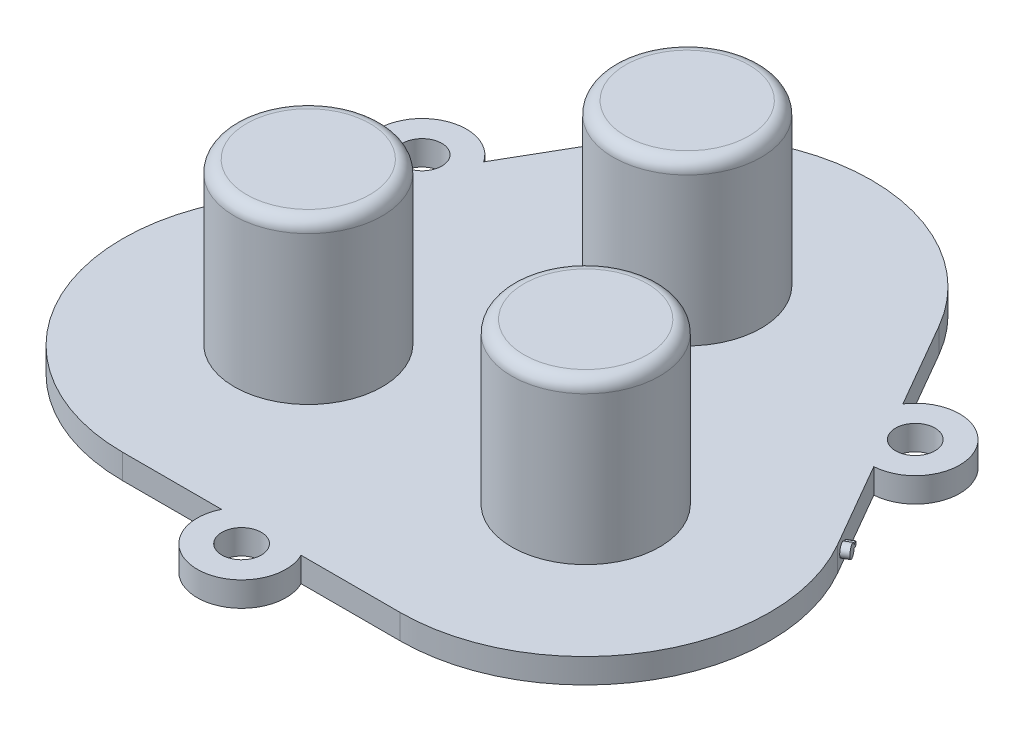
ISO-10303-21;
HEADER;
FILE_DESCRIPTION(('STEP AP214'),'2;1');
FILE_NAME('part.step','',(''),(''),'','','');
FILE_SCHEMA(('AUTOMOTIVE_DESIGN { 1 0 10303 214 1 1 1 1 }'));
ENDSEC;
DATA;
#1=APPLICATION_CONTEXT('core data for automotive mechanical design processes');
#2=APPLICATION_PROTOCOL_DEFINITION('international standard','automotive_design',2000,#1);
#3=PRODUCT_CONTEXT('',#1,'mechanical');
#4=PRODUCT('Part','Part','',(#3));
#5=PRODUCT_RELATED_PRODUCT_CATEGORY('part','',(#4));
#6=PRODUCT_DEFINITION_FORMATION('','',#4);
#7=PRODUCT_DEFINITION_CONTEXT('part definition',#1,'design');
#8=PRODUCT_DEFINITION('design','',#6,#7);
#9=PRODUCT_DEFINITION_SHAPE('','',#8);
#10=(LENGTH_UNIT() NAMED_UNIT(*) SI_UNIT(.MILLI.,.METRE.));
#11=(NAMED_UNIT(*) PLANE_ANGLE_UNIT() SI_UNIT($,.RADIAN.));
#12=(NAMED_UNIT(*) SI_UNIT($,.STERADIAN.) SOLID_ANGLE_UNIT());
#13=UNCERTAINTY_MEASURE_WITH_UNIT(LENGTH_MEASURE(1.E-05),#10,'distance_accuracy_value','');
#14=(GEOMETRIC_REPRESENTATION_CONTEXT(3) GLOBAL_UNCERTAINTY_ASSIGNED_CONTEXT((#13)) GLOBAL_UNIT_ASSIGNED_CONTEXT((#10,
#11,#12)) REPRESENTATION_CONTEXT('',''));
#15=CARTESIAN_POINT('',(0.,0.,0.));
#16=DIRECTION('',(0.,0.,1.));
#17=DIRECTION('',(1.,0.,0.));
#18=AXIS2_PLACEMENT_3D('',#15,#16,#17);
#19=CARTESIAN_POINT('',(-11.2500000511737,2.,7.14278559354404));
#20=DIRECTION('',(0.,1.,0.));
#21=DIRECTION('',(0.,0.,1.));
#22=AXIS2_PLACEMENT_3D('',#19,#20,#21);
#23=PLANE('',#22);
#24=CARTESIAN_POINT('',(-11.3100251260065,2.,7.02273544387849));
#25=DIRECTION('',(0.,1.,0.));
#26=DIRECTION('',(0.,0.,1.));
#27=AXIS2_PLACEMENT_3D('',#24,#25,#26);
#28=CIRCLE('',#27,6.);
#29=CARTESIAN_POINT('',(-11.3100251260065,2.,13.0227354438785));
#30=VERTEX_POINT('',#29);
#31=EDGE_CURVE('E330',#30,#30,#28,.F.);
#32=ORIENTED_EDGE('',*,*,#31,.T.);
#33=EDGE_LOOP('',(#32));
#34=FACE_BOUND('',#33,.T.);
#35=CARTESIAN_POINT('',(11.1899748739934,2.,7.02273544387849));
#36=DIRECTION('',(0.,1.,0.));
#37=DIRECTION('',(0.,0.,1.));
#38=AXIS2_PLACEMENT_3D('',#35,#36,#37);
#39=CIRCLE('',#38,6.);
#40=CARTESIAN_POINT('',(11.1899748739934,2.,13.0227354438785));
#41=VERTEX_POINT('',#40);
#42=EDGE_CURVE('E331',#41,#41,#39,.F.);
#43=ORIENTED_EDGE('',*,*,#42,.T.);
#44=EDGE_LOOP('',(#43));
#45=FACE_BOUND('',#44,.T.);
#46=CARTESIAN_POINT('',(-0.0600251260065108,2.,-12.4628361412714));
#47=DIRECTION('',(0.,1.,0.));
#48=DIRECTION('',(0.,0.,1.));
#49=AXIS2_PLACEMENT_3D('',#46,#47,#48);
#50=CIRCLE('',#49,6.);
#51=CARTESIAN_POINT('',(-0.0600251260065108,2.,-6.4628361412714));
#52=VERTEX_POINT('',#51);
#53=EDGE_CURVE('E335',#52,#52,#50,.F.);
#54=ORIENTED_EDGE('',*,*,#53,.T.);
#55=EDGE_LOOP('',(#54));
#56=FACE_BOUND('',#55,.T.);
#57=CARTESIAN_POINT('',(-20.0010217539954,2.,-10.9000001990309));
#58=DIRECTION('',(0.,1.,0.));
#59=DIRECTION('',(0.,0.,1.));
#60=AXIS2_PLACEMENT_3D('',#57,#58,#59);
#61=CIRCLE('',#60,1.6);
#62=CARTESIAN_POINT('',(-20.0010217539954,2.,-9.30000019903093));
#63=VERTEX_POINT('',#62);
#64=EDGE_CURVE('E350',#63,#63,#61,.T.);
#65=ORIENTED_EDGE('',*,*,#64,.F.);
#66=EDGE_LOOP('',(#65));
#67=FACE_BOUND('',#66,.T.);
#68=CARTESIAN_POINT('',(-11.2500000511737,2.,7.14278559354404));
#69=DIRECTION('',(0.,1.,0.));
#70=DIRECTION('',(0.,0.,1.));
#71=AXIS2_PLACEMENT_3D('',#68,#69,#70);
#72=CIRCLE('',#71,15.);
#73=CARTESIAN_POINT('',(-24.2403811079403,2.,-0.357214406455925));
#74=VERTEX_POINT('',#73);
#75=CARTESIAN_POINT('',(-11.2500000511737,2.,22.142785593544));
#76=VERTEX_POINT('',#75);
#77=EDGE_CURVE('E198',#74,#76,#72,.T.);
#78=ORIENTED_EDGE('',*,*,#77,.T.);
#79=DIRECTION('',(1.,0.,0.));
#80=VECTOR('',#79,1.);
#81=CARTESIAN_POINT('',(-11.2500000511737,2.,22.142785593544));
#82=LINE('',#81,#80);
#83=CARTESIAN_POINT('',(-3.2249031504929,2.,22.1427855935441));
#84=VERTEX_POINT('',#83);
#85=EDGE_CURVE('E118',#76,#84,#82,.T.);
#86=ORIENTED_EDGE('',*,*,#85,.T.);
#87=CARTESIAN_POINT('',(-5.11722688081806E-08,2.,23.7427855935431));
#88=DIRECTION('',(0.,1.,0.));
#89=DIRECTION('',(0.,0.,1.));
#90=AXIS2_PLACEMENT_3D('',#87,#88,#89);
#91=CIRCLE('',#90,3.60000000000066);
#92=CARTESIAN_POINT('',(3.22490304814838,2.,22.1427855935442));
#93=VERTEX_POINT('',#92);
#94=EDGE_CURVE('E362',#84,#93,#91,.T.);
#95=ORIENTED_EDGE('',*,*,#94,.T.);
#96=DIRECTION('',(1.,0.,0.));
#97=VECTOR('',#96,1.);
#98=CARTESIAN_POINT('',(3.22490304814839,2.,22.1427855935442));
#99=LINE('',#98,#97);
#100=CARTESIAN_POINT('',(11.2499999488263,2.,22.1427855935442));
#101=VERTEX_POINT('',#100);
#102=EDGE_CURVE('E364',#93,#101,#99,.T.);
#103=ORIENTED_EDGE('',*,*,#102,.T.);
#104=CARTESIAN_POINT('',(11.2499999488264,2.,7.14278559354415));
#105=DIRECTION('',(0.,1.,0.));
#106=DIRECTION('',(0.,0.,1.));
#107=AXIS2_PLACEMENT_3D('',#104,#105,#106);
#108=CIRCLE('',#107,15.0000000000001);
#109=CARTESIAN_POINT('',(24.240381005593,2.,-0.357214406456034));
#110=VERTEX_POINT('',#109);
#111=EDGE_CURVE('E366',#101,#110,#108,.T.);
#112=ORIENTED_EDGE('',*,*,#111,.T.);
#113=DIRECTION('',(-0.500000000000005,0.,-0.866025403784436));
#114=VECTOR('',#113,1.);
#115=CARTESIAN_POINT('',(24.240381005593,2.,-0.357214406456022));
#116=LINE('',#115,#114);
#117=CARTESIAN_POINT('',(20.2278325552526,2.,-7.30715219027712));
#118=VERTEX_POINT('',#117);
#119=EDGE_CURVE('E368',#110,#118,#116,.T.);
#120=ORIENTED_EDGE('',*,*,#119,.T.);
#121=CARTESIAN_POINT('',(20.0010216516479,2.,-10.9000001990326));
#122=DIRECTION('',(0.,1.,0.));
#123=DIRECTION('',(0.,0.,1.));
#124=AXIS2_PLACEMENT_3D('',#121,#122,#123);
#125=CIRCLE('',#124,3.60000000000172);
#126=CARTESIAN_POINT('',(17.0029294559317,2.,-12.8928482077873));
#127=VERTEX_POINT('',#126);
#128=EDGE_CURVE('E370',#118,#127,#125,.T.);
#129=ORIENTED_EDGE('',*,*,#128,.T.);
#130=DIRECTION('',(-0.500000000000005,0.,-0.866025403784436));
#131=VECTOR('',#130,1.);
#132=CARTESIAN_POINT('',(17.0029294559317,2.,-12.8928482077873));
#133=LINE('',#132,#131);
#134=CARTESIAN_POINT('',(12.9903810055928,2.,-19.8427859916058));
#135=VERTEX_POINT('',#134);
#136=EDGE_CURVE('E372',#127,#135,#133,.T.);
#137=ORIENTED_EDGE('',*,*,#136,.T.);
#138=CARTESIAN_POINT('',(-5.11737398924087E-08,2.,-12.3427859916057));
#139=DIRECTION('',(0.,1.,0.));
#140=DIRECTION('',(0.,0.,1.));
#141=AXIS2_PLACEMENT_3D('',#138,#139,#140);
#142=CIRCLE('',#141,15.0000000000001);
#143=CARTESIAN_POINT('',(-12.9903811079403,2.,-19.8427859916058));
#144=VERTEX_POINT('',#143);
#145=EDGE_CURVE('E153',#135,#144,#142,.T.);
#146=ORIENTED_EDGE('',*,*,#145,.T.);
#147=DIRECTION('',(-0.499999999999998,0.,0.86602540378444));
#148=VECTOR('',#147,1.);
#149=CARTESIAN_POINT('',(-12.9903811079403,2.,-19.8427859916058));
#150=LINE('',#149,#148);
#151=CARTESIAN_POINT('',(-17.0029295582806,2.,-12.8928482077847));
#152=VERTEX_POINT('',#151);
#153=EDGE_CURVE('E146',#144,#152,#150,.T.);
#154=ORIENTED_EDGE('',*,*,#153,.T.);
#155=CARTESIAN_POINT('',(-20.0010217539954,2.,-10.9000001990309));
#156=DIRECTION('',(0.,1.,0.));
#157=DIRECTION('',(0.,0.,1.));
#158=AXIS2_PLACEMENT_3D('',#155,#156,#157);
#159=CIRCLE('',#158,3.6);
#160=CARTESIAN_POINT('',(-20.2278326576,2.,-7.30715219027715));
#161=VERTEX_POINT('',#160);
#162=EDGE_CURVE('E150',#152,#161,#159,.T.);
#163=ORIENTED_EDGE('',*,*,#162,.T.);
#164=DIRECTION('',(-0.499999999999998,0.,0.86602540378444));
#165=VECTOR('',#164,1.);
#166=CARTESIAN_POINT('',(-20.2278326576,2.,-7.30715219027714));
#167=LINE('',#166,#165);
#168=EDGE_CURVE('E64',#161,#74,#167,.T.);
#169=ORIENTED_EDGE('',*,*,#168,.T.);
#170=EDGE_LOOP('',(#78,#86,#95,#103,#112,#120,#129,#137,#146,#154,#163,#169));
#171=FACE_BOUND('',#170,.T.);
#172=CARTESIAN_POINT('',(-5.11722688081806E-08,2.,23.7427855935431));
#173=DIRECTION('',(0.,1.,0.));
#174=DIRECTION('',(0.,0.,1.));
#175=AXIS2_PLACEMENT_3D('',#172,#173,#174);
#176=CIRCLE('',#175,1.60000000000066);
#177=CARTESIAN_POINT('',(-5.11722688081806E-08,2.,25.3427855935438));
#178=VERTEX_POINT('',#177);
#179=EDGE_CURVE('E178',#178,#178,#176,.T.);
#180=ORIENTED_EDGE('',*,*,#179,.F.);
#181=EDGE_LOOP('',(#180));
#182=FACE_BOUND('',#181,.T.);
#183=CARTESIAN_POINT('',(20.0010216516479,2.,-10.9000001990326));
#184=DIRECTION('',(0.,1.,0.));
#185=DIRECTION('',(0.,0.,1.));
#186=AXIS2_PLACEMENT_3D('',#183,#184,#185);
#187=CIRCLE('',#186,1.60000000000172);
#188=CARTESIAN_POINT('',(20.0010216516479,2.,-9.30000019903091));
#189=VERTEX_POINT('',#188);
#190=EDGE_CURVE('E344',#189,#189,#187,.T.);
#191=ORIENTED_EDGE('',*,*,#190,.F.);
#192=EDGE_LOOP('',(#191));
#193=FACE_BOUND('',#192,.T.);
#194=ADVANCED_FACE('F41',(#34,#45,#56,#67,#171,#182,#193),#23,.T.);
#195=CARTESIAN_POINT('',(-11.2500000511737,0.,7.14278559354404));
#196=DIRECTION('',(0.,1.,0.));
#197=DIRECTION('',(0.,0.,1.));
#198=AXIS2_PLACEMENT_3D('',#195,#196,#197);
#199=PLANE('',#198);
#200=CARTESIAN_POINT('',(-11.2500000511737,0.,7.14278559354404));
#201=DIRECTION('',(0.,1.,0.));
#202=DIRECTION('',(0.,0.,1.));
#203=AXIS2_PLACEMENT_3D('',#200,#201,#202);
#204=CIRCLE('',#203,15.);
#205=CARTESIAN_POINT('',(-24.2403811079403,0.,-0.357214406455925));
#206=VERTEX_POINT('',#205);
#207=CARTESIAN_POINT('',(-11.2500000511737,0.,22.142785593544));
#208=VERTEX_POINT('',#207);
#209=EDGE_CURVE('E174',#206,#208,#204,.T.);
#210=ORIENTED_EDGE('',*,*,#209,.F.);
#211=DIRECTION('',(-0.499999999999998,0.,0.86602540378444));
#212=VECTOR('',#211,1.);
#213=CARTESIAN_POINT('',(-20.2278326576,0.,-7.30715219027714));
#214=LINE('',#213,#212);
#215=CARTESIAN_POINT('',(-20.2278326576,0.,-7.30715219027715));
#216=VERTEX_POINT('',#215);
#217=EDGE_CURVE('E109',#216,#206,#214,.T.);
#218=ORIENTED_EDGE('',*,*,#217,.F.);
#219=CARTESIAN_POINT('',(-20.0010217539954,0.,-10.9000001990309));
#220=DIRECTION('',(0.,1.,0.));
#221=DIRECTION('',(0.,0.,1.));
#222=AXIS2_PLACEMENT_3D('',#219,#220,#221);
#223=CIRCLE('',#222,3.6);
#224=CARTESIAN_POINT('',(-17.0029295582806,0.,-12.8928482077847));
#225=VERTEX_POINT('',#224);
#226=EDGE_CURVE('E195',#225,#216,#223,.T.);
#227=ORIENTED_EDGE('',*,*,#226,.F.);
#228=DIRECTION('',(-0.499999999999998,0.,0.86602540378444));
#229=VECTOR('',#228,1.);
#230=CARTESIAN_POINT('',(-12.9903811079403,0.,-19.8427859916058));
#231=LINE('',#230,#229);
#232=CARTESIAN_POINT('',(-12.9903811079403,0.,-19.8427859916058));
#233=VERTEX_POINT('',#232);
#234=EDGE_CURVE('E162',#233,#225,#231,.T.);
#235=ORIENTED_EDGE('',*,*,#234,.F.);
#236=CARTESIAN_POINT('',(-5.11737398924087E-08,0.,-12.3427859916057));
#237=DIRECTION('',(0.,1.,0.));
#238=DIRECTION('',(0.,0.,1.));
#239=AXIS2_PLACEMENT_3D('',#236,#237,#238);
#240=CIRCLE('',#239,15.0000000000001);
#241=CARTESIAN_POINT('',(12.9903810055928,0.,-19.8427859916058));
#242=VERTEX_POINT('',#241);
#243=EDGE_CURVE('E192',#242,#233,#240,.T.);
#244=ORIENTED_EDGE('',*,*,#243,.F.);
#245=DIRECTION('',(-0.500000000000005,0.,-0.866025403784436));
#246=VECTOR('',#245,1.);
#247=CARTESIAN_POINT('',(17.0029294559317,0.,-12.8928482077873));
#248=LINE('',#247,#246);
#249=CARTESIAN_POINT('',(17.0029294559317,0.,-12.8928482077873));
#250=VERTEX_POINT('',#249);
#251=EDGE_CURVE('E190',#250,#242,#248,.T.);
#252=ORIENTED_EDGE('',*,*,#251,.F.);
#253=CARTESIAN_POINT('',(20.0010216516479,0.,-10.9000001990326));
#254=DIRECTION('',(0.,1.,0.));
#255=DIRECTION('',(0.,0.,1.));
#256=AXIS2_PLACEMENT_3D('',#253,#254,#255);
#257=CIRCLE('',#256,3.60000000000172);
#258=CARTESIAN_POINT('',(20.2278325552526,0.,-7.30715219027712));
#259=VERTEX_POINT('',#258);
#260=EDGE_CURVE('E188',#259,#250,#257,.T.);
#261=ORIENTED_EDGE('',*,*,#260,.F.);
#262=DIRECTION('',(-0.500000000000005,0.,-0.866025403784436));
#263=VECTOR('',#262,1.);
#264=CARTESIAN_POINT('',(24.240381005593,0.,-0.357214406456022));
#265=LINE('',#264,#263);
#266=CARTESIAN_POINT('',(24.240381005593,0.,-0.357214406456034));
#267=VERTEX_POINT('',#266);
#268=EDGE_CURVE('E186',#267,#259,#265,.T.);
#269=ORIENTED_EDGE('',*,*,#268,.F.);
#270=CARTESIAN_POINT('',(11.2499999488264,0.,7.14278559354415));
#271=DIRECTION('',(0.,1.,0.));
#272=DIRECTION('',(0.,0.,1.));
#273=AXIS2_PLACEMENT_3D('',#270,#271,#272);
#274=CIRCLE('',#273,15.0000000000001);
#275=CARTESIAN_POINT('',(11.2499999488263,0.,22.1427855935442));
#276=VERTEX_POINT('',#275);
#277=EDGE_CURVE('E184',#276,#267,#274,.T.);
#278=ORIENTED_EDGE('',*,*,#277,.F.);
#279=DIRECTION('',(1.,0.,0.));
#280=VECTOR('',#279,1.);
#281=CARTESIAN_POINT('',(3.22490304814839,0.,22.1427855935442));
#282=LINE('',#281,#280);
#283=CARTESIAN_POINT('',(3.22490304814838,0.,22.1427855935442));
#284=VERTEX_POINT('',#283);
#285=EDGE_CURVE('E182',#284,#276,#282,.T.);
#286=ORIENTED_EDGE('',*,*,#285,.F.);
#287=CARTESIAN_POINT('',(-5.11722688081806E-08,0.,23.7427855935431));
#288=DIRECTION('',(0.,1.,0.));
#289=DIRECTION('',(0.,0.,1.));
#290=AXIS2_PLACEMENT_3D('',#287,#288,#289);
#291=CIRCLE('',#290,3.60000000000066);
#292=CARTESIAN_POINT('',(-3.2249031504929,0.,22.1427855935441));
#293=VERTEX_POINT('',#292);
#294=EDGE_CURVE('E180',#293,#284,#291,.T.);
#295=ORIENTED_EDGE('',*,*,#294,.F.);
#296=DIRECTION('',(1.,0.,0.));
#297=VECTOR('',#296,1.);
#298=CARTESIAN_POINT('',(-11.2500000511737,0.,22.142785593544));
#299=LINE('',#298,#297);
#300=EDGE_CURVE('E177',#208,#293,#299,.T.);
#301=ORIENTED_EDGE('',*,*,#300,.F.);
#302=EDGE_LOOP('',(#210,#218,#227,#235,#244,#252,#261,#269,#278,#286,#295,#301));
#303=FACE_BOUND('',#302,.T.);
#304=CARTESIAN_POINT('',(-5.11722688081806E-08,0.,23.7427855935431));
#305=DIRECTION('',(0.,1.,0.));
#306=DIRECTION('',(0.,0.,1.));
#307=AXIS2_PLACEMENT_3D('',#304,#305,#306);
#308=CIRCLE('',#307,1.60000000000066);
#309=CARTESIAN_POINT('',(-5.11722688081806E-08,0.,25.3427855935438));
#310=VERTEX_POINT('',#309);
#311=EDGE_CURVE('E353',#310,#310,#308,.T.);
#312=ORIENTED_EDGE('',*,*,#311,.T.);
#313=EDGE_LOOP('',(#312));
#314=FACE_BOUND('',#313,.T.);
#315=CARTESIAN_POINT('',(-20.0010217539954,0.,-10.9000001990309));
#316=DIRECTION('',(0.,1.,0.));
#317=DIRECTION('',(0.,0.,1.));
#318=AXIS2_PLACEMENT_3D('',#315,#316,#317);
#319=CIRCLE('',#318,1.6);
#320=CARTESIAN_POINT('',(-20.0010217539954,0.,-9.30000019903093));
#321=VERTEX_POINT('',#320);
#322=EDGE_CURVE('E347',#321,#321,#319,.T.);
#323=ORIENTED_EDGE('',*,*,#322,.T.);
#324=EDGE_LOOP('',(#323));
#325=FACE_BOUND('',#324,.T.);
#326=CARTESIAN_POINT('',(20.0010216516479,0.,-10.9000001990326));
#327=DIRECTION('',(0.,1.,0.));
#328=DIRECTION('',(0.,0.,1.));
#329=AXIS2_PLACEMENT_3D('',#326,#327,#328);
#330=CIRCLE('',#329,1.60000000000172);
#331=CARTESIAN_POINT('',(20.0010216516479,0.,-9.30000019903091));
#332=VERTEX_POINT('',#331);
#333=EDGE_CURVE('E343',#332,#332,#330,.T.);
#334=ORIENTED_EDGE('',*,*,#333,.T.);
#335=EDGE_LOOP('',(#334));
#336=FACE_BOUND('',#335,.T.);
#337=ADVANCED_FACE('F257',(#303,#314,#325,#336),#199,.F.);
#338=CARTESIAN_POINT('',(-11.2500000511737,2.,7.14278559354404));
#339=DIRECTION('',(0.,-1.,0.));
#340=DIRECTION('',(0.,0.,-1.));
#341=AXIS2_PLACEMENT_3D('',#338,#339,#340);
#342=CYLINDRICAL_SURFACE('',#341,15.);
#343=ORIENTED_EDGE('',*,*,#209,.T.);
#344=DIRECTION('',(0.,-1.,0.));
#345=VECTOR('',#344,1.);
#346=CARTESIAN_POINT('',(-11.2500000511737,2.,22.142785593544));
#347=LINE('',#346,#345);
#348=EDGE_CURVE('E223',#76,#208,#347,.T.);
#349=ORIENTED_EDGE('',*,*,#348,.F.);
#350=ORIENTED_EDGE('',*,*,#77,.F.);
#351=DIRECTION('',(0.,-1.,0.));
#352=VECTOR('',#351,1.);
#353=CARTESIAN_POINT('',(-24.2403811079403,2.,-0.357214406455925));
#354=LINE('',#353,#352);
#355=EDGE_CURVE('E170',#74,#206,#354,.T.);
#356=ORIENTED_EDGE('',*,*,#355,.T.);
#357=EDGE_LOOP('',(#343,#349,#350,#356));
#358=FACE_BOUND('',#357,.T.);
#359=ADVANCED_FACE('F264',(#358),#342,.T.);
#360=CARTESIAN_POINT('',(-11.2500000511737,2.,22.142785593544));
#361=DIRECTION('',(0.,0.,-1.));
#362=DIRECTION('',(-1.,0.,0.));
#363=AXIS2_PLACEMENT_3D('',#360,#361,#362);
#364=PLANE('',#363);
#365=ORIENTED_EDGE('',*,*,#300,.T.);
#366=DIRECTION('',(0.,-1.,0.));
#367=VECTOR('',#366,1.);
#368=CARTESIAN_POINT('',(-3.2249031504929,2.,22.1427855935441));
#369=LINE('',#368,#367);
#370=EDGE_CURVE('E220',#84,#293,#369,.T.);
#371=ORIENTED_EDGE('',*,*,#370,.F.);
#372=ORIENTED_EDGE('',*,*,#85,.F.);
#373=ORIENTED_EDGE('',*,*,#348,.T.);
#374=EDGE_LOOP('',(#365,#371,#372,#373));
#375=FACE_BOUND('',#374,.T.);
#376=ADVANCED_FACE('F305',(#375),#364,.F.);
#377=CARTESIAN_POINT('',(-5.11722688081806E-08,2.,23.7427855935431));
#378=DIRECTION('',(0.,-1.,0.));
#379=DIRECTION('',(0.,0.,-1.));
#380=AXIS2_PLACEMENT_3D('',#377,#378,#379);
#381=CYLINDRICAL_SURFACE('',#380,3.60000000000066);
#382=ORIENTED_EDGE('',*,*,#294,.T.);
#383=DIRECTION('',(0.,-1.,0.));
#384=VECTOR('',#383,1.);
#385=CARTESIAN_POINT('',(3.22490304814838,2.,22.1427855935442));
#386=LINE('',#385,#384);
#387=EDGE_CURVE('E217',#93,#284,#386,.T.);
#388=ORIENTED_EDGE('',*,*,#387,.F.);
#389=ORIENTED_EDGE('',*,*,#94,.F.);
#390=ORIENTED_EDGE('',*,*,#370,.T.);
#391=EDGE_LOOP('',(#382,#388,#389,#390));
#392=FACE_BOUND('',#391,.T.);
#393=ADVANCED_FACE('F301',(#392),#381,.T.);
#394=CARTESIAN_POINT('',(3.22490304814839,2.,22.1427855935442));
#395=DIRECTION('',(0.,0.,-1.));
#396=DIRECTION('',(-1.,0.,0.));
#397=AXIS2_PLACEMENT_3D('',#394,#395,#396);
#398=PLANE('',#397);
#399=ORIENTED_EDGE('',*,*,#285,.T.);
#400=DIRECTION('',(0.,-1.,0.));
#401=VECTOR('',#400,1.);
#402=CARTESIAN_POINT('',(11.2499999488263,2.,22.1427855935442));
#403=LINE('',#402,#401);
#404=EDGE_CURVE('E214',#101,#276,#403,.T.);
#405=ORIENTED_EDGE('',*,*,#404,.F.);
#406=ORIENTED_EDGE('',*,*,#102,.F.);
#407=ORIENTED_EDGE('',*,*,#387,.T.);
#408=EDGE_LOOP('',(#399,#405,#406,#407));
#409=FACE_BOUND('',#408,.T.);
#410=ADVANCED_FACE('F297',(#409),#398,.F.);
#411=CARTESIAN_POINT('',(11.2499999488264,2.,7.14278559354415));
#412=DIRECTION('',(0.,-1.,0.));
#413=DIRECTION('',(0.,0.,-1.));
#414=AXIS2_PLACEMENT_3D('',#411,#412,#413);
#415=CYLINDRICAL_SURFACE('',#414,15.0000000000001);
#416=ORIENTED_EDGE('',*,*,#277,.T.);
#417=DIRECTION('',(0.,-1.,0.));
#418=VECTOR('',#417,1.);
#419=CARTESIAN_POINT('',(24.240381005593,2.,-0.357214406456034));
#420=LINE('',#419,#418);
#421=EDGE_CURVE('E211',#110,#267,#420,.T.);
#422=ORIENTED_EDGE('',*,*,#421,.F.);
#423=ORIENTED_EDGE('',*,*,#111,.F.);
#424=ORIENTED_EDGE('',*,*,#404,.T.);
#425=EDGE_LOOP('',(#416,#422,#423,#424));
#426=FACE_BOUND('',#425,.T.);
#427=ADVANCED_FACE('F294',(#426),#415,.T.);
#428=CARTESIAN_POINT('',(24.240381005593,2.,-0.357214406456022));
#429=DIRECTION('',(-0.866025403784436,0.,0.500000000000005));
#430=DIRECTION('',(0.500000000000005,0.,0.866025403784436));
#431=AXIS2_PLACEMENT_3D('',#428,#429,#430);
#432=PLANE('',#431);
#433=CARTESIAN_POINT('',(23.4095247745026,1.,-1.7962996124898));
#434=DIRECTION('',(0.866025403784436,0.,-0.500000000000005));
#435=DIRECTION('',(-0.500000000000005,0.,-0.866025403784436));
#436=AXIS2_PLACEMENT_3D('',#433,#434,#435);
#437=CIRCLE('',#436,0.199999999999999);
#438=CARTESIAN_POINT('',(23.5059716138844,0.947160349234695,-1.62924878645098));
#439=VERTEX_POINT('',#438);
#440=CARTESIAN_POINT('',(23.5059716138844,1.05283965076531,-1.62924878645098));
#441=VERTEX_POINT('',#440);
#442=EDGE_CURVE('E446',#439,#441,#437,.T.);
#443=ORIENTED_EDGE('',*,*,#442,.F.);
#444=CARTESIAN_POINT('',(23.7545716799076,1.,-1.19866084133379));
#445=DIRECTION('',(0.866025403784436,0.,-0.500000000000005));
#446=DIRECTION('',(-0.500000000000005,0.,-0.866025403784436));
#447=AXIS2_PLACEMENT_3D('',#444,#445,#446);
#448=CIRCLE('',#447,0.5);
#449=EDGE_CURVE('E55',#441,#439,#448,.T.);
#450=ORIENTED_EDGE('',*,*,#449,.F.);
#451=EDGE_LOOP('',(#443,#450));
#452=FACE_BOUND('',#451,.T.);
#453=ORIENTED_EDGE('',*,*,#268,.T.);
#454=DIRECTION('',(0.,-1.,0.));
#455=VECTOR('',#454,1.);
#456=CARTESIAN_POINT('',(20.2278325552526,2.,-7.30715219027712));
#457=LINE('',#456,#455);
#458=EDGE_CURVE('E208',#118,#259,#457,.T.);
#459=ORIENTED_EDGE('',*,*,#458,.F.);
#460=ORIENTED_EDGE('',*,*,#119,.F.);
#461=ORIENTED_EDGE('',*,*,#421,.T.);
#462=EDGE_LOOP('',(#453,#459,#460,#461));
#463=FACE_BOUND('',#462,.T.);
#464=ADVANCED_FACE('F291',(#452,#463),#432,.F.);
#465=CARTESIAN_POINT('',(20.0010216516479,2.,-10.9000001990326));
#466=DIRECTION('',(0.,-1.,0.));
#467=DIRECTION('',(0.,0.,-1.));
#468=AXIS2_PLACEMENT_3D('',#465,#466,#467);
#469=CYLINDRICAL_SURFACE('',#468,3.60000000000172);
#470=ORIENTED_EDGE('',*,*,#260,.T.);
#471=DIRECTION('',(0.,-1.,0.));
#472=VECTOR('',#471,1.);
#473=CARTESIAN_POINT('',(17.0029294559317,2.,-12.8928482077873));
#474=LINE('',#473,#472);
#475=EDGE_CURVE('E205',#127,#250,#474,.T.);
#476=ORIENTED_EDGE('',*,*,#475,.F.);
#477=ORIENTED_EDGE('',*,*,#128,.F.);
#478=ORIENTED_EDGE('',*,*,#458,.T.);
#479=EDGE_LOOP('',(#470,#476,#477,#478));
#480=FACE_BOUND('',#479,.T.);
#481=ADVANCED_FACE('F287',(#480),#469,.T.);
#482=CARTESIAN_POINT('',(17.0029294559317,2.,-12.8928482077873));
#483=DIRECTION('',(-0.866025403784436,0.,0.500000000000005));
#484=DIRECTION('',(0.500000000000005,0.,0.866025403784436));
#485=AXIS2_PLACEMENT_3D('',#482,#483,#484);
#486=PLANE('',#485);
#487=ORIENTED_EDGE('',*,*,#251,.T.);
#488=DIRECTION('',(0.,-1.,0.));
#489=VECTOR('',#488,1.);
#490=CARTESIAN_POINT('',(12.9903810055928,2.,-19.8427859916058));
#491=LINE('',#490,#489);
#492=EDGE_CURVE('E202',#135,#242,#491,.T.);
#493=ORIENTED_EDGE('',*,*,#492,.F.);
#494=ORIENTED_EDGE('',*,*,#136,.F.);
#495=ORIENTED_EDGE('',*,*,#475,.T.);
#496=EDGE_LOOP('',(#487,#493,#494,#495));
#497=FACE_BOUND('',#496,.T.);
#498=ADVANCED_FACE('F283',(#497),#486,.F.);
#499=CARTESIAN_POINT('',(-5.11737398924087E-08,2.,-12.3427859916057));
#500=DIRECTION('',(0.,-1.,0.));
#501=DIRECTION('',(0.,0.,-1.));
#502=AXIS2_PLACEMENT_3D('',#499,#500,#501);
#503=CYLINDRICAL_SURFACE('',#502,15.0000000000001);
#504=ORIENTED_EDGE('',*,*,#243,.T.);
#505=DIRECTION('',(0.,-1.,0.));
#506=VECTOR('',#505,1.);
#507=CARTESIAN_POINT('',(-12.9903811079403,2.,-19.8427859916058));
#508=LINE('',#507,#506);
#509=EDGE_CURVE('E165',#144,#233,#508,.T.);
#510=ORIENTED_EDGE('',*,*,#509,.F.);
#511=ORIENTED_EDGE('',*,*,#145,.F.);
#512=ORIENTED_EDGE('',*,*,#492,.T.);
#513=EDGE_LOOP('',(#504,#510,#511,#512));
#514=FACE_BOUND('',#513,.T.);
#515=ADVANCED_FACE('F280',(#514),#503,.T.);
#516=CARTESIAN_POINT('',(-12.9903811079403,2.,-19.8427859916058));
#517=DIRECTION('',(0.86602540378444,0.,0.499999999999998));
#518=DIRECTION('',(0.499999999999998,0.,-0.86602540378444));
#519=AXIS2_PLACEMENT_3D('',#516,#517,#518);
#520=PLANE('',#519);
#521=ORIENTED_EDGE('',*,*,#234,.T.);
#522=DIRECTION('',(0.,-1.,0.));
#523=VECTOR('',#522,1.);
#524=CARTESIAN_POINT('',(-17.0029295582806,2.,-12.8928482077847));
#525=LINE('',#524,#523);
#526=EDGE_CURVE('E159',#152,#225,#525,.T.);
#527=ORIENTED_EDGE('',*,*,#526,.F.);
#528=ORIENTED_EDGE('',*,*,#153,.F.);
#529=ORIENTED_EDGE('',*,*,#509,.T.);
#530=EDGE_LOOP('',(#521,#527,#528,#529));
#531=FACE_BOUND('',#530,.T.);
#532=ADVANCED_FACE('F160',(#531),#520,.F.);
#533=CARTESIAN_POINT('',(-20.0010217539954,2.,-10.9000001990309));
#534=DIRECTION('',(0.,-1.,0.));
#535=DIRECTION('',(0.,0.,-1.));
#536=AXIS2_PLACEMENT_3D('',#533,#534,#535);
#537=CYLINDRICAL_SURFACE('',#536,3.6);
#538=ORIENTED_EDGE('',*,*,#226,.T.);
#539=DIRECTION('',(0.,-1.,0.));
#540=VECTOR('',#539,1.);
#541=CARTESIAN_POINT('',(-20.2278326576,2.,-7.30715219027715));
#542=LINE('',#541,#540);
#543=EDGE_CURVE('E166',#161,#216,#542,.T.);
#544=ORIENTED_EDGE('',*,*,#543,.F.);
#545=ORIENTED_EDGE('',*,*,#162,.F.);
#546=ORIENTED_EDGE('',*,*,#526,.T.);
#547=EDGE_LOOP('',(#538,#544,#545,#546));
#548=FACE_BOUND('',#547,.T.);
#549=ADVANCED_FACE('F168',(#548),#537,.T.);
#550=CARTESIAN_POINT('',(-20.2278326576,2.,-7.30715219027714));
#551=DIRECTION('',(0.86602540378444,0.,0.499999999999998));
#552=DIRECTION('',(0.499999999999998,0.,-0.86602540378444));
#553=AXIS2_PLACEMENT_3D('',#550,#551,#552);
#554=PLANE('',#553);
#555=ORIENTED_EDGE('',*,*,#217,.T.);
#556=ORIENTED_EDGE('',*,*,#355,.F.);
#557=ORIENTED_EDGE('',*,*,#168,.F.);
#558=ORIENTED_EDGE('',*,*,#543,.T.);
#559=EDGE_LOOP('',(#555,#556,#557,#558));
#560=FACE_BOUND('',#559,.T.);
#561=ADVANCED_FACE('F273',(#560),#554,.F.);
#562=CARTESIAN_POINT('',(-5.11722688081806E-08,2.,23.7427855935431));
#563=DIRECTION('',(0.,-1.,0.));
#564=DIRECTION('',(0.,0.,-1.));
#565=AXIS2_PLACEMENT_3D('',#562,#563,#564);
#566=CYLINDRICAL_SURFACE('',#565,1.60000000000066);
#567=ORIENTED_EDGE('',*,*,#179,.T.);
#568=EDGE_LOOP('',(#567));
#569=FACE_BOUND('',#568,.T.);
#570=ORIENTED_EDGE('',*,*,#311,.F.);
#571=EDGE_LOOP('',(#570));
#572=FACE_BOUND('',#571,.T.);
#573=ADVANCED_FACE('F270',(#569,#572),#566,.F.);
#574=CARTESIAN_POINT('',(-20.0010217539954,2.,-10.9000001990309));
#575=DIRECTION('',(0.,-1.,0.));
#576=DIRECTION('',(0.,0.,-1.));
#577=AXIS2_PLACEMENT_3D('',#574,#575,#576);
#578=CYLINDRICAL_SURFACE('',#577,1.6);
#579=ORIENTED_EDGE('',*,*,#64,.T.);
#580=EDGE_LOOP('',(#579));
#581=FACE_BOUND('',#580,.T.);
#582=ORIENTED_EDGE('',*,*,#322,.F.);
#583=EDGE_LOOP('',(#582));
#584=FACE_BOUND('',#583,.T.);
#585=ADVANCED_FACE('F405',(#581,#584),#578,.F.);
#586=CARTESIAN_POINT('',(20.0010216516479,2.,-10.9000001990326));
#587=DIRECTION('',(0.,-1.,0.));
#588=DIRECTION('',(0.,0.,-1.));
#589=AXIS2_PLACEMENT_3D('',#586,#587,#588);
#590=CYLINDRICAL_SURFACE('',#589,1.60000000000172);
#591=ORIENTED_EDGE('',*,*,#190,.T.);
#592=EDGE_LOOP('',(#591));
#593=FACE_BOUND('',#592,.T.);
#594=ORIENTED_EDGE('',*,*,#333,.F.);
#595=EDGE_LOOP('',(#594));
#596=FACE_BOUND('',#595,.T.);
#597=ADVANCED_FACE('F403',(#593,#596),#590,.F.);
#598=CARTESIAN_POINT('',(-0.0600251260065108,15.,-12.4628361412714));
#599=DIRECTION('',(0.,-1.,0.));
#600=DIRECTION('',(0.,0.,-1.));
#601=AXIS2_PLACEMENT_3D('',#598,#599,#600);
#602=CYLINDRICAL_SURFACE('',#601,6.);
#603=CARTESIAN_POINT('',(-0.0600251260065108,14.,-12.4628361412714));
#604=DIRECTION('',(0.,1.,0.));
#605=DIRECTION('',(0.,0.,1.));
#606=AXIS2_PLACEMENT_3D('',#603,#604,#605);
#607=CIRCLE('',#606,6.);
#608=CARTESIAN_POINT('',(-0.0600251260065108,14.,-6.4628361412714));
#609=VERTEX_POINT('',#608);
#610=EDGE_CURVE('E11',#609,#609,#607,.F.);
#611=ORIENTED_EDGE('',*,*,#610,.T.);
#612=EDGE_LOOP('',(#611));
#613=FACE_BOUND('',#612,.T.);
#614=ORIENTED_EDGE('',*,*,#53,.F.);
#615=EDGE_LOOP('',(#614));
#616=FACE_BOUND('',#615,.T.);
#617=ADVANCED_FACE('F404',(#613,#616),#602,.T.);
#618=CARTESIAN_POINT('',(-0.0600251260065108,15.,-12.4628361412714));
#619=DIRECTION('',(0.,1.,0.));
#620=DIRECTION('',(0.,0.,1.));
#621=AXIS2_PLACEMENT_3D('',#618,#619,#620);
#622=PLANE('',#621);
#623=CARTESIAN_POINT('',(-0.0600251260065108,15.,-12.4628361412714));
#624=DIRECTION('',(0.,1.,0.));
#625=DIRECTION('',(0.,0.,1.));
#626=AXIS2_PLACEMENT_3D('',#623,#624,#625);
#627=CIRCLE('',#626,5.);
#628=CARTESIAN_POINT('',(-0.0600251260065108,15.,-7.4628361412714));
#629=VERTEX_POINT('',#628);
#630=EDGE_CURVE('E49',#629,#629,#627,.T.);
#631=ORIENTED_EDGE('',*,*,#630,.T.);
#632=EDGE_LOOP('',(#631));
#633=FACE_BOUND('',#632,.T.);
#634=ADVANCED_FACE('F239',(#633),#622,.T.);
#635=CARTESIAN_POINT('',(11.1899748739934,15.,7.02273544387849));
#636=DIRECTION('',(0.,-1.,0.));
#637=DIRECTION('',(0.,0.,-1.));
#638=AXIS2_PLACEMENT_3D('',#635,#636,#637);
#639=CYLINDRICAL_SURFACE('',#638,6.);
#640=CARTESIAN_POINT('',(11.1899748739934,14.,7.02273544387849));
#641=DIRECTION('',(0.,1.,0.));
#642=DIRECTION('',(0.,0.,1.));
#643=AXIS2_PLACEMENT_3D('',#640,#641,#642);
#644=CIRCLE('',#643,6.);
#645=CARTESIAN_POINT('',(11.1899748739934,14.,13.0227354438785));
#646=VERTEX_POINT('',#645);
#647=EDGE_CURVE('E234',#646,#646,#644,.F.);
#648=ORIENTED_EDGE('',*,*,#647,.T.);
#649=EDGE_LOOP('',(#648));
#650=FACE_BOUND('',#649,.T.);
#651=ORIENTED_EDGE('',*,*,#42,.F.);
#652=EDGE_LOOP('',(#651));
#653=FACE_BOUND('',#652,.T.);
#654=ADVANCED_FACE('F418',(#650,#653),#639,.T.);
#655=CARTESIAN_POINT('',(11.1899748739934,15.,7.02273544387849));
#656=DIRECTION('',(0.,1.,0.));
#657=DIRECTION('',(0.,0.,1.));
#658=AXIS2_PLACEMENT_3D('',#655,#656,#657);
#659=PLANE('',#658);
#660=CARTESIAN_POINT('',(11.1899748739934,15.,7.02273544387849));
#661=DIRECTION('',(0.,1.,0.));
#662=DIRECTION('',(0.,0.,1.));
#663=AXIS2_PLACEMENT_3D('',#660,#661,#662);
#664=CIRCLE('',#663,5.);
#665=CARTESIAN_POINT('',(11.1899748739934,15.,12.0227354438785));
#666=VERTEX_POINT('',#665);
#667=EDGE_CURVE('E231',#666,#666,#664,.T.);
#668=ORIENTED_EDGE('',*,*,#667,.T.);
#669=EDGE_LOOP('',(#668));
#670=FACE_BOUND('',#669,.T.);
#671=ADVANCED_FACE('F327',(#670),#659,.T.);
#672=CARTESIAN_POINT('',(-11.3100251260065,15.,7.02273544387849));
#673=DIRECTION('',(0.,-1.,0.));
#674=DIRECTION('',(0.,0.,-1.));
#675=AXIS2_PLACEMENT_3D('',#672,#673,#674);
#676=CYLINDRICAL_SURFACE('',#675,6.);
#677=CARTESIAN_POINT('',(-11.3100251260065,14.,7.02273544387849));
#678=DIRECTION('',(0.,1.,0.));
#679=DIRECTION('',(0.,0.,1.));
#680=AXIS2_PLACEMENT_3D('',#677,#678,#679);
#681=CIRCLE('',#680,6.);
#682=CARTESIAN_POINT('',(-11.3100251260065,14.,13.0227354438785));
#683=VERTEX_POINT('',#682);
#684=EDGE_CURVE('E228',#683,#683,#681,.F.);
#685=ORIENTED_EDGE('',*,*,#684,.T.);
#686=EDGE_LOOP('',(#685));
#687=FACE_BOUND('',#686,.T.);
#688=ORIENTED_EDGE('',*,*,#31,.F.);
#689=EDGE_LOOP('',(#688));
#690=FACE_BOUND('',#689,.T.);
#691=ADVANCED_FACE('F318',(#687,#690),#676,.T.);
#692=CARTESIAN_POINT('',(-11.3100251260065,15.,7.02273544387849));
#693=DIRECTION('',(0.,1.,0.));
#694=DIRECTION('',(0.,0.,1.));
#695=AXIS2_PLACEMENT_3D('',#692,#693,#694);
#696=PLANE('',#695);
#697=CARTESIAN_POINT('',(-11.3100251260065,15.,7.02273544387849));
#698=DIRECTION('',(0.,1.,0.));
#699=DIRECTION('',(0.,0.,1.));
#700=AXIS2_PLACEMENT_3D('',#697,#698,#699);
#701=CIRCLE('',#700,5.);
#702=CARTESIAN_POINT('',(-11.3100251260065,15.,12.0227354438785));
#703=VERTEX_POINT('',#702);
#704=EDGE_CURVE('E225',#703,#703,#701,.T.);
#705=ORIENTED_EDGE('',*,*,#704,.T.);
#706=EDGE_LOOP('',(#705));
#707=FACE_BOUND('',#706,.T.);
#708=ADVANCED_FACE('F313',(#707),#696,.T.);
#709=CARTESIAN_POINT('',(-11.3100251260065,14.,7.02273544387849));
#710=DIRECTION('',(0.,1.,0.));
#711=DIRECTION('',(0.,0.,1.));
#712=AXIS2_PLACEMENT_3D('',#709,#710,#711);
#713=TOROIDAL_SURFACE('',#712,5.,1.);
#714=ORIENTED_EDGE('',*,*,#684,.F.);
#715=EDGE_LOOP('',(#714));
#716=FACE_BOUND('',#715,.T.);
#717=ORIENTED_EDGE('',*,*,#704,.F.);
#718=EDGE_LOOP('',(#717));
#719=FACE_BOUND('',#718,.T.);
#720=ADVANCED_FACE('F253',(#716,#719),#713,.T.);
#721=CARTESIAN_POINT('',(11.1899748739934,14.,7.02273544387849));
#722=DIRECTION('',(0.,1.,0.));
#723=DIRECTION('',(0.,0.,1.));
#724=AXIS2_PLACEMENT_3D('',#721,#722,#723);
#725=TOROIDAL_SURFACE('',#724,5.,1.);
#726=ORIENTED_EDGE('',*,*,#647,.F.);
#727=EDGE_LOOP('',(#726));
#728=FACE_BOUND('',#727,.T.);
#729=ORIENTED_EDGE('',*,*,#667,.F.);
#730=EDGE_LOOP('',(#729));
#731=FACE_BOUND('',#730,.T.);
#732=ADVANCED_FACE('F243',(#728,#731),#725,.T.);
#733=CARTESIAN_POINT('',(-0.0600251260065108,14.,-12.4628361412714));
#734=DIRECTION('',(0.,1.,0.));
#735=DIRECTION('',(0.,0.,1.));
#736=AXIS2_PLACEMENT_3D('',#733,#734,#735);
#737=TOROIDAL_SURFACE('',#736,5.,1.);
#738=ORIENTED_EDGE('',*,*,#610,.F.);
#739=EDGE_LOOP('',(#738));
#740=FACE_BOUND('',#739,.T.);
#741=ORIENTED_EDGE('',*,*,#630,.F.);
#742=EDGE_LOOP('',(#741));
#743=FACE_BOUND('',#742,.T.);
#744=ADVANCED_FACE('F43',(#740,#743),#737,.T.);
#745=CARTESIAN_POINT('',(23.9291400167732,1.,-2.0962996124898));
#746=DIRECTION('',(-0.866025403784436,0.,0.500000000000005));
#747=DIRECTION('',(0.500000000000005,0.,0.866025403784436));
#748=AXIS2_PLACEMENT_3D('',#745,#746,#747);
#749=CYLINDRICAL_SURFACE('',#748,0.199999999999999);
#750=ORIENTED_EDGE('',*,*,#442,.T.);
#751=DIRECTION('',(-0.866025403784436,0.,0.500000000000005));
#752=VECTOR('',#751,1.);
#753=CARTESIAN_POINT('',(24.0255868561551,1.05283965076531,-1.92924878645099));
#754=LINE('',#753,#752);
#755=CARTESIAN_POINT('',(24.0255868561551,1.05283965076531,-1.92924878645099));
#756=VERTEX_POINT('',#755);
#757=EDGE_CURVE('E332',#756,#441,#754,.T.);
#758=ORIENTED_EDGE('',*,*,#757,.F.);
#759=CARTESIAN_POINT('',(23.9291400167732,1.,-2.0962996124898));
#760=DIRECTION('',(0.866025403784436,0.,-0.500000000000005));
#761=DIRECTION('',(-0.500000000000005,0.,-0.866025403784436));
#762=AXIS2_PLACEMENT_3D('',#759,#760,#761);
#763=CIRCLE('',#762,0.199999999999999);
#764=CARTESIAN_POINT('',(24.0255868561551,0.947160349234695,-1.92924878645099));
#765=VERTEX_POINT('',#764);
#766=EDGE_CURVE('E437',#765,#756,#763,.T.);
#767=ORIENTED_EDGE('',*,*,#766,.F.);
#768=DIRECTION('',(-0.866025403784436,0.,0.500000000000005));
#769=VECTOR('',#768,1.);
#770=CARTESIAN_POINT('',(24.0255868561551,0.947160349234695,-1.92924878645099));
#771=LINE('',#770,#769);
#772=EDGE_CURVE('E337',#765,#439,#771,.T.);
#773=ORIENTED_EDGE('',*,*,#772,.T.);
#774=EDGE_LOOP('',(#750,#758,#767,#773));
#775=FACE_BOUND('',#774,.T.);
#776=ADVANCED_FACE('F242',(#775),#749,.T.);
#777=CARTESIAN_POINT('',(24.2741869221783,1.,-1.49866084133379));
#778=DIRECTION('',(-0.866025403784436,0.,0.500000000000005));
#779=DIRECTION('',(0.500000000000005,0.,0.866025403784436));
#780=AXIS2_PLACEMENT_3D('',#777,#778,#779);
#781=CYLINDRICAL_SURFACE('',#780,0.5);
#782=ORIENTED_EDGE('',*,*,#449,.T.);
#783=ORIENTED_EDGE('',*,*,#772,.F.);
#784=CARTESIAN_POINT('',(24.2741869221783,1.,-1.49866084133379));
#785=DIRECTION('',(0.866025403784436,0.,-0.500000000000005));
#786=DIRECTION('',(-0.500000000000005,0.,-0.866025403784436));
#787=AXIS2_PLACEMENT_3D('',#784,#785,#786);
#788=CIRCLE('',#787,0.5);
#789=EDGE_CURVE('E440',#756,#765,#788,.T.);
#790=ORIENTED_EDGE('',*,*,#789,.F.);
#791=ORIENTED_EDGE('',*,*,#757,.T.);
#792=EDGE_LOOP('',(#782,#783,#790,#791));
#793=FACE_BOUND('',#792,.T.);
#794=ADVANCED_FACE('F250',(#793),#781,.T.);
#795=CARTESIAN_POINT('',(24.1016634694758,1.,-1.79748022691179));
#796=DIRECTION('',(0.866025403784436,0.,-0.500000000000005));
#797=DIRECTION('',(-0.500000000000005,0.,-0.866025403784436));
#798=AXIS2_PLACEMENT_3D('',#795,#796,#797);
#799=PLANE('',#798);
#800=ORIENTED_EDGE('',*,*,#766,.T.);
#801=ORIENTED_EDGE('',*,*,#789,.T.);
#802=EDGE_LOOP('',(#800,#801));
#803=FACE_BOUND('',#802,.T.);
#804=ADVANCED_FACE('F427',(#803),#799,.T.);
#805=CLOSED_SHELL('',(#194,#337,#359,#376,#393,#410,#427,#464,#481,#498,#515,#532,#549,#561,
#573,#585,#597,#617,#634,#654,#671,#691,#708,#720,#732,#744,#776,#794,#804));
#806=MANIFOLD_SOLID_BREP('B2',#805);
#807=ADVANCED_BREP_SHAPE_REPRESENTATION('',(#18,#806),#14);
#808=SHAPE_DEFINITION_REPRESENTATION(#9,#807);
ENDSEC;
END-ISO-10303-21;
